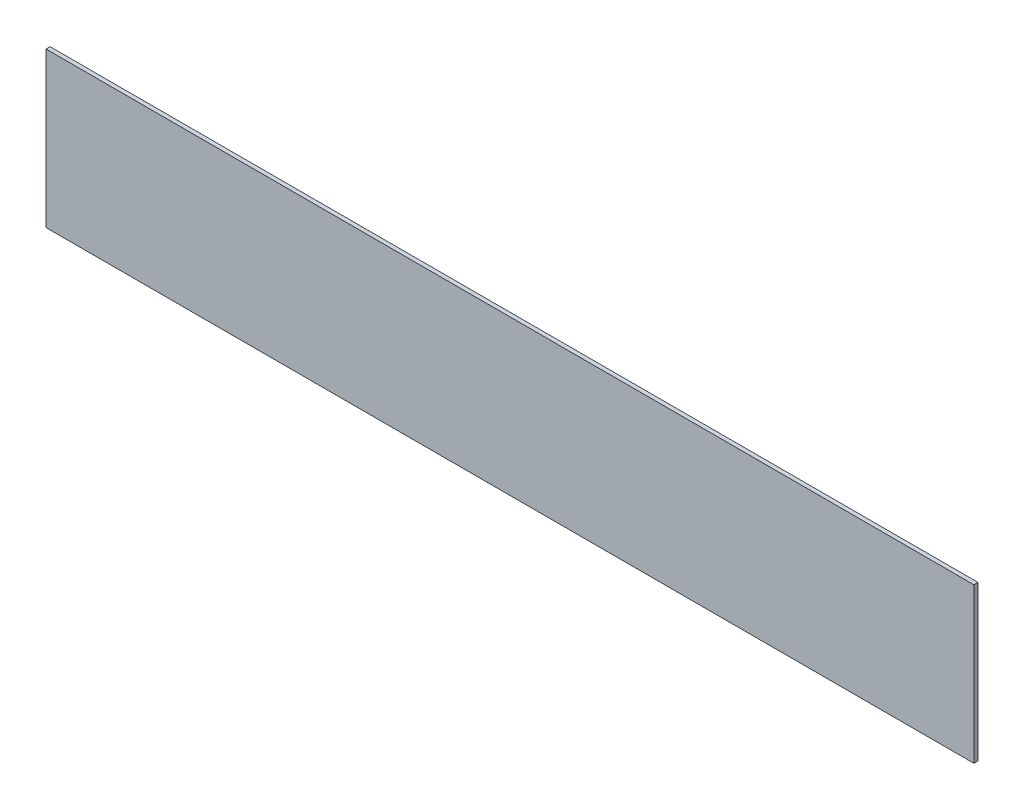
ISO-10303-21;
HEADER;
FILE_DESCRIPTION(('STEP AP214'),'2;1');
FILE_NAME('part.step','',(''),(''),'','','');
FILE_SCHEMA(('AUTOMOTIVE_DESIGN { 1 0 10303 214 1 1 1 1 }'));
ENDSEC;
DATA;
#1=APPLICATION_CONTEXT('core data for automotive mechanical design processes');
#2=APPLICATION_PROTOCOL_DEFINITION('international standard','automotive_design',2000,#1);
#3=PRODUCT_CONTEXT('',#1,'mechanical');
#4=PRODUCT('Part','Part','',(#3));
#5=PRODUCT_RELATED_PRODUCT_CATEGORY('part','',(#4));
#6=PRODUCT_DEFINITION_FORMATION('','',#4);
#7=PRODUCT_DEFINITION_CONTEXT('part definition',#1,'design');
#8=PRODUCT_DEFINITION('design','',#6,#7);
#9=PRODUCT_DEFINITION_SHAPE('','',#8);
#10=(LENGTH_UNIT() NAMED_UNIT(*) SI_UNIT(.MILLI.,.METRE.));
#11=(NAMED_UNIT(*) PLANE_ANGLE_UNIT() SI_UNIT($,.RADIAN.));
#12=(NAMED_UNIT(*) SI_UNIT($,.STERADIAN.) SOLID_ANGLE_UNIT());
#13=UNCERTAINTY_MEASURE_WITH_UNIT(LENGTH_MEASURE(1.E-05),#10,'distance_accuracy_value','');
#14=(GEOMETRIC_REPRESENTATION_CONTEXT(3) GLOBAL_UNCERTAINTY_ASSIGNED_CONTEXT((#13)) GLOBAL_UNIT_ASSIGNED_CONTEXT((#10,
#11,#12)) REPRESENTATION_CONTEXT('',''));
#15=CARTESIAN_POINT('',(0.,0.,0.));
#16=DIRECTION('',(0.,0.,1.));
#17=DIRECTION('',(1.,0.,0.));
#18=AXIS2_PLACEMENT_3D('',#15,#16,#17);
#19=CARTESIAN_POINT('',(228.6,38.1,2.));
#20=DIRECTION('',(-1.,0.,0.));
#21=DIRECTION('',(0.,-1.,0.));
#22=AXIS2_PLACEMENT_3D('',#19,#20,#21);
#23=PLANE('',#22);
#24=DIRECTION('',(0.,1.,0.));
#25=VECTOR('',#24,1.);
#26=CARTESIAN_POINT('',(228.6,38.1,0.));
#27=LINE('',#26,#25);
#28=CARTESIAN_POINT('',(228.6,-38.1,0.));
#29=VERTEX_POINT('',#28);
#30=CARTESIAN_POINT('',(228.6,38.1,0.));
#31=VERTEX_POINT('',#30);
#32=EDGE_CURVE('E97',#29,#31,#27,.T.);
#33=ORIENTED_EDGE('',*,*,#32,.T.);
#34=DIRECTION('',(0.,0.,-1.));
#35=VECTOR('',#34,1.);
#36=CARTESIAN_POINT('',(228.6,38.1,2.));
#37=LINE('',#36,#35);
#38=CARTESIAN_POINT('',(228.6,38.1,2.));
#39=VERTEX_POINT('',#38);
#40=EDGE_CURVE('E11',#39,#31,#37,.T.);
#41=ORIENTED_EDGE('',*,*,#40,.F.);
#42=DIRECTION('',(0.,1.,0.));
#43=VECTOR('',#42,1.);
#44=CARTESIAN_POINT('',(228.6,38.1,2.));
#45=LINE('',#44,#43);
#46=CARTESIAN_POINT('',(228.6,-38.1,2.));
#47=VERTEX_POINT('',#46);
#48=EDGE_CURVE('E85',#47,#39,#45,.T.);
#49=ORIENTED_EDGE('',*,*,#48,.F.);
#50=DIRECTION('',(0.,0.,-1.));
#51=VECTOR('',#50,1.);
#52=CARTESIAN_POINT('',(228.6,-38.1,2.));
#53=LINE('',#52,#51);
#54=EDGE_CURVE('E93',#47,#29,#53,.T.);
#55=ORIENTED_EDGE('',*,*,#54,.T.);
#56=EDGE_LOOP('',(#33,#41,#49,#55));
#57=FACE_BOUND('',#56,.T.);
#58=ADVANCED_FACE('F34',(#57),#23,.F.);
#59=CARTESIAN_POINT('',(-228.6,38.1,2.));
#60=DIRECTION('',(0.,-1.,0.));
#61=DIRECTION('',(0.,0.,-1.));
#62=AXIS2_PLACEMENT_3D('',#59,#60,#61);
#63=PLANE('',#62);
#64=DIRECTION('',(-1.,0.,0.));
#65=VECTOR('',#64,1.);
#66=CARTESIAN_POINT('',(-228.6,38.1,0.));
#67=LINE('',#66,#65);
#68=CARTESIAN_POINT('',(-228.6,38.1,0.));
#69=VERTEX_POINT('',#68);
#70=EDGE_CURVE('E89',#31,#69,#67,.T.);
#71=ORIENTED_EDGE('',*,*,#70,.T.);
#72=DIRECTION('',(0.,0.,-1.));
#73=VECTOR('',#72,1.);
#74=CARTESIAN_POINT('',(-228.6,38.1,2.));
#75=LINE('',#74,#73);
#76=CARTESIAN_POINT('',(-228.6,38.1,2.));
#77=VERTEX_POINT('',#76);
#78=EDGE_CURVE('E42',#77,#69,#75,.T.);
#79=ORIENTED_EDGE('',*,*,#78,.F.);
#80=DIRECTION('',(-1.,0.,0.));
#81=VECTOR('',#80,1.);
#82=CARTESIAN_POINT('',(-228.6,38.1,2.));
#83=LINE('',#82,#81);
#84=EDGE_CURVE('E80',#39,#77,#83,.T.);
#85=ORIENTED_EDGE('',*,*,#84,.F.);
#86=ORIENTED_EDGE('',*,*,#40,.T.);
#87=EDGE_LOOP('',(#71,#79,#85,#86));
#88=FACE_BOUND('',#87,.T.);
#89=ADVANCED_FACE('F88',(#88),#63,.F.);
#90=CARTESIAN_POINT('',(-228.6,38.1,2.));
#91=DIRECTION('',(1.,0.,0.));
#92=DIRECTION('',(0.,0.,-1.));
#93=AXIS2_PLACEMENT_3D('',#90,#91,#92);
#94=PLANE('',#93);
#95=DIRECTION('',(0.,-1.,0.));
#96=VECTOR('',#95,1.);
#97=CARTESIAN_POINT('',(-228.6,38.1,0.));
#98=LINE('',#97,#96);
#99=CARTESIAN_POINT('',(-228.6,-38.1,0.));
#100=VERTEX_POINT('',#99);
#101=EDGE_CURVE('E67',#69,#100,#98,.T.);
#102=ORIENTED_EDGE('',*,*,#101,.T.);
#103=DIRECTION('',(0.,0.,-1.));
#104=VECTOR('',#103,1.);
#105=CARTESIAN_POINT('',(-228.6,-38.1,2.));
#106=LINE('',#105,#104);
#107=CARTESIAN_POINT('',(-228.6,-38.1,2.));
#108=VERTEX_POINT('',#107);
#109=EDGE_CURVE('E90',#108,#100,#106,.T.);
#110=ORIENTED_EDGE('',*,*,#109,.F.);
#111=DIRECTION('',(0.,-1.,0.));
#112=VECTOR('',#111,1.);
#113=CARTESIAN_POINT('',(-228.6,38.1,2.));
#114=LINE('',#113,#112);
#115=EDGE_CURVE('E83',#77,#108,#114,.T.);
#116=ORIENTED_EDGE('',*,*,#115,.F.);
#117=ORIENTED_EDGE('',*,*,#78,.T.);
#118=EDGE_LOOP('',(#102,#110,#116,#117));
#119=FACE_BOUND('',#118,.T.);
#120=ADVANCED_FACE('F91',(#119),#94,.F.);
#121=CARTESIAN_POINT('',(-228.6,-38.1,2.));
#122=DIRECTION('',(0.,1.,0.));
#123=DIRECTION('',(0.,0.,1.));
#124=AXIS2_PLACEMENT_3D('',#121,#122,#123);
#125=PLANE('',#124);
#126=DIRECTION('',(1.,0.,0.));
#127=VECTOR('',#126,1.);
#128=CARTESIAN_POINT('',(-228.6,-38.1,0.));
#129=LINE('',#128,#127);
#130=EDGE_CURVE('E73',#100,#29,#129,.T.);
#131=ORIENTED_EDGE('',*,*,#130,.T.);
#132=ORIENTED_EDGE('',*,*,#54,.F.);
#133=DIRECTION('',(1.,0.,0.));
#134=VECTOR('',#133,1.);
#135=CARTESIAN_POINT('',(-228.6,-38.1,2.));
#136=LINE('',#135,#134);
#137=EDGE_CURVE('E50',#108,#47,#136,.T.);
#138=ORIENTED_EDGE('',*,*,#137,.F.);
#139=ORIENTED_EDGE('',*,*,#109,.T.);
#140=EDGE_LOOP('',(#131,#132,#138,#139));
#141=FACE_BOUND('',#140,.T.);
#142=ADVANCED_FACE('F104',(#141),#125,.F.);
#143=CARTESIAN_POINT('',(0.,0.,2.));
#144=DIRECTION('',(0.,0.,1.));
#145=DIRECTION('',(1.,0.,0.));
#146=AXIS2_PLACEMENT_3D('',#143,#144,#145);
#147=PLANE('',#146);
#148=ORIENTED_EDGE('',*,*,#48,.T.);
#149=ORIENTED_EDGE('',*,*,#84,.T.);
#150=ORIENTED_EDGE('',*,*,#115,.T.);
#151=ORIENTED_EDGE('',*,*,#137,.T.);
#152=EDGE_LOOP('',(#148,#149,#150,#151));
#153=FACE_BOUND('',#152,.T.);
#154=ADVANCED_FACE('F81',(#153),#147,.T.);
#155=CARTESIAN_POINT('',(0.,0.,0.));
#156=DIRECTION('',(0.,0.,1.));
#157=DIRECTION('',(1.,0.,0.));
#158=AXIS2_PLACEMENT_3D('',#155,#156,#157);
#159=PLANE('',#158);
#160=ORIENTED_EDGE('',*,*,#32,.F.);
#161=ORIENTED_EDGE('',*,*,#130,.F.);
#162=ORIENTED_EDGE('',*,*,#101,.F.);
#163=ORIENTED_EDGE('',*,*,#70,.F.);
#164=EDGE_LOOP('',(#160,#161,#162,#163));
#165=FACE_BOUND('',#164,.T.);
#166=ADVANCED_FACE('F107',(#165),#159,.F.);
#167=CLOSED_SHELL('',(#58,#89,#120,#142,#154,#166));
#168=MANIFOLD_SOLID_BREP('B2',#167);
#169=ADVANCED_BREP_SHAPE_REPRESENTATION('',(#18,#168),#14);
#170=SHAPE_DEFINITION_REPRESENTATION(#9,#169);
ENDSEC;
END-ISO-10303-21;
